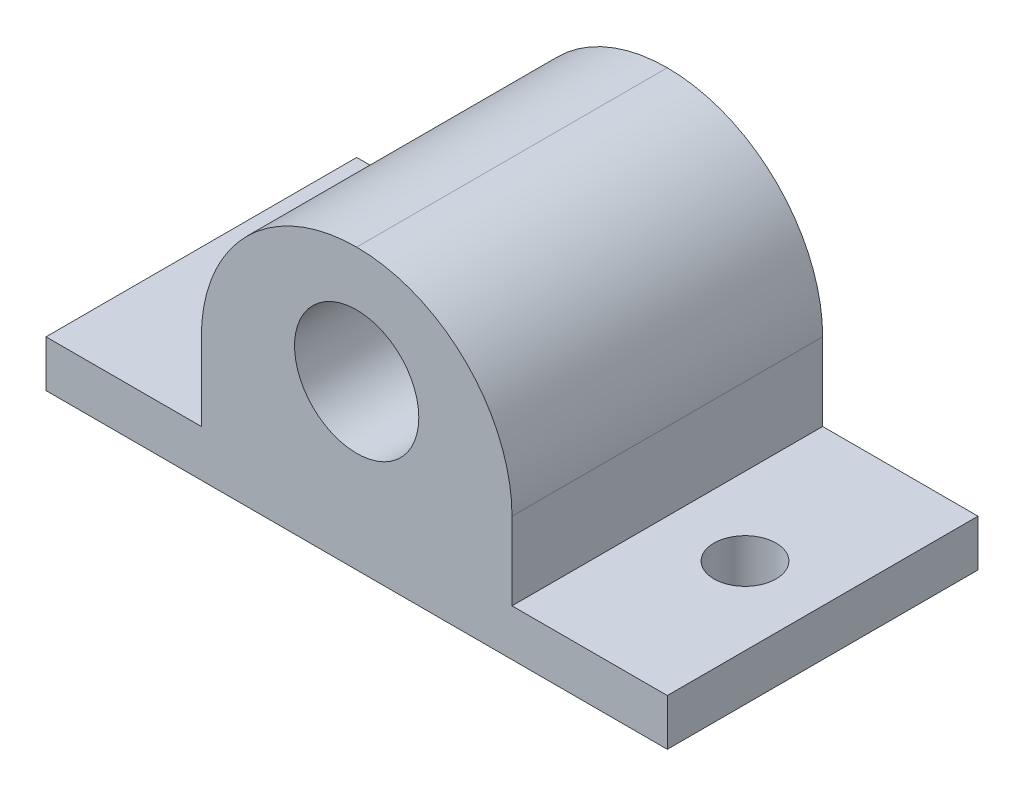
ISO-10303-21;
HEADER;
FILE_DESCRIPTION(('STEP AP214'),'2;1');
FILE_NAME('part.step','',(''),(''),'','','');
FILE_SCHEMA(('AUTOMOTIVE_DESIGN { 1 0 10303 214 1 1 1 1 }'));
ENDSEC;
DATA;
#1=APPLICATION_CONTEXT('core data for automotive mechanical design processes');
#2=APPLICATION_PROTOCOL_DEFINITION('international standard','automotive_design',2000,#1);
#3=PRODUCT_CONTEXT('',#1,'mechanical');
#4=PRODUCT('Part','Part','',(#3));
#5=PRODUCT_RELATED_PRODUCT_CATEGORY('part','',(#4));
#6=PRODUCT_DEFINITION_FORMATION('','',#4);
#7=PRODUCT_DEFINITION_CONTEXT('part definition',#1,'design');
#8=PRODUCT_DEFINITION('design','',#6,#7);
#9=PRODUCT_DEFINITION_SHAPE('','',#8);
#10=(LENGTH_UNIT() NAMED_UNIT(*) SI_UNIT(.MILLI.,.METRE.));
#11=(NAMED_UNIT(*) PLANE_ANGLE_UNIT() SI_UNIT($,.RADIAN.));
#12=(NAMED_UNIT(*) SI_UNIT($,.STERADIAN.) SOLID_ANGLE_UNIT());
#13=UNCERTAINTY_MEASURE_WITH_UNIT(LENGTH_MEASURE(1.E-05),#10,'distance_accuracy_value','');
#14=(GEOMETRIC_REPRESENTATION_CONTEXT(3) GLOBAL_UNCERTAINTY_ASSIGNED_CONTEXT((#13)) GLOBAL_UNIT_ASSIGNED_CONTEXT((#10,
#11,#12)) REPRESENTATION_CONTEXT('',''));
#15=CARTESIAN_POINT('',(0.,0.,0.));
#16=DIRECTION('',(0.,0.,1.));
#17=DIRECTION('',(1.,0.,0.));
#18=AXIS2_PLACEMENT_3D('',#15,#16,#17);
#19=CARTESIAN_POINT('',(0.,3.,0.));
#20=DIRECTION('',(0.,-1.,0.));
#21=DIRECTION('',(0.,0.,-1.));
#22=AXIS2_PLACEMENT_3D('',#19,#20,#21);
#23=PLANE('',#22);
#24=CARTESIAN_POINT('',(5.,3.,-10.));
#25=DIRECTION('',(0.,1.,0.));
#26=DIRECTION('',(0.,0.,1.));
#27=AXIS2_PLACEMENT_3D('',#24,#25,#26);
#28=CIRCLE('',#27,2.);
#29=CARTESIAN_POINT('',(5.,3.,-8.));
#30=VERTEX_POINT('',#29);
#31=EDGE_CURVE('E352',#30,#30,#28,.T.);
#32=ORIENTED_EDGE('',*,*,#31,.F.);
#33=EDGE_LOOP('',(#32));
#34=FACE_BOUND('',#33,.T.);
#35=DIRECTION('',(0.,0.,1.));
#36=VECTOR('',#35,1.);
#37=CARTESIAN_POINT('',(10.,3.,-20.));
#38=LINE('',#37,#36);
#39=CARTESIAN_POINT('',(10.,3.,-20.));
#40=VERTEX_POINT('',#39);
#41=CARTESIAN_POINT('',(10.,3.,0.));
#42=VERTEX_POINT('',#41);
#43=EDGE_CURVE('E127',#40,#42,#38,.T.);
#44=ORIENTED_EDGE('',*,*,#43,.F.);
#45=DIRECTION('',(-1.,0.,0.));
#46=VECTOR('',#45,1.);
#47=CARTESIAN_POINT('',(0.,3.,-20.));
#48=LINE('',#47,#46);
#49=CARTESIAN_POINT('',(0.,3.,-20.));
#50=VERTEX_POINT('',#49);
#51=EDGE_CURVE('E124',#40,#50,#48,.T.);
#52=ORIENTED_EDGE('',*,*,#51,.T.);
#53=DIRECTION('',(0.,0.,1.));
#54=VECTOR('',#53,1.);
#55=CARTESIAN_POINT('',(0.,3.,0.));
#56=LINE('',#55,#54);
#57=CARTESIAN_POINT('',(0.,3.,0.));
#58=VERTEX_POINT('',#57);
#59=EDGE_CURVE('E144',#50,#58,#56,.T.);
#60=ORIENTED_EDGE('',*,*,#59,.T.);
#61=DIRECTION('',(1.,0.,0.));
#62=VECTOR('',#61,1.);
#63=CARTESIAN_POINT('',(0.,3.,0.));
#64=LINE('',#63,#62);
#65=EDGE_CURVE('E154',#58,#42,#64,.T.);
#66=ORIENTED_EDGE('',*,*,#65,.T.);
#67=EDGE_LOOP('',(#44,#52,#60,#66));
#68=FACE_BOUND('',#67,.T.);
#69=ADVANCED_FACE('F33',(#34,#68),#23,.F.);
#70=CARTESIAN_POINT('',(35.,3.,-10.));
#71=DIRECTION('',(0.,1.,0.));
#72=DIRECTION('',(0.,0.,1.));
#73=AXIS2_PLACEMENT_3D('',#70,#71,#72);
#74=CIRCLE('',#73,2.);
#75=CARTESIAN_POINT('',(35.,3.,-8.));
#76=VERTEX_POINT('',#75);
#77=EDGE_CURVE('E354',#76,#76,#74,.T.);
#78=ORIENTED_EDGE('',*,*,#77,.F.);
#79=EDGE_LOOP('',(#78));
#80=FACE_BOUND('',#79,.T.);
#81=DIRECTION('',(0.,0.,-1.));
#82=VECTOR('',#81,1.);
#83=CARTESIAN_POINT('',(30.,3.,-20.));
#84=LINE('',#83,#82);
#85=CARTESIAN_POINT('',(30.,3.,0.));
#86=VERTEX_POINT('',#85);
#87=CARTESIAN_POINT('',(30.,3.,-20.));
#88=VERTEX_POINT('',#87);
#89=EDGE_CURVE('E118',#86,#88,#84,.T.);
#90=ORIENTED_EDGE('',*,*,#89,.F.);
#91=CARTESIAN_POINT('',(40.,3.,0.));
#92=VERTEX_POINT('',#91);
#93=EDGE_CURVE('E147',#86,#92,#64,.T.);
#94=ORIENTED_EDGE('',*,*,#93,.T.);
#95=DIRECTION('',(0.,0.,-1.));
#96=VECTOR('',#95,1.);
#97=CARTESIAN_POINT('',(40.,3.,0.));
#98=LINE('',#97,#96);
#99=CARTESIAN_POINT('',(40.,3.,-20.));
#100=VERTEX_POINT('',#99);
#101=EDGE_CURVE('E121',#92,#100,#98,.T.);
#102=ORIENTED_EDGE('',*,*,#101,.T.);
#103=EDGE_CURVE('E105',#100,#88,#48,.T.);
#104=ORIENTED_EDGE('',*,*,#103,.T.);
#105=EDGE_LOOP('',(#90,#94,#102,#104));
#106=FACE_BOUND('',#105,.T.);
#107=ADVANCED_FACE('F117',(#80,#106),#23,.F.);
#108=CARTESIAN_POINT('',(0.,3.,0.));
#109=DIRECTION('',(1.,0.,0.));
#110=DIRECTION('',(0.,0.,-1.));
#111=AXIS2_PLACEMENT_3D('',#108,#109,#110);
#112=PLANE('',#111);
#113=DIRECTION('',(0.,0.,1.));
#114=VECTOR('',#113,1.);
#115=CARTESIAN_POINT('',(0.,0.,0.));
#116=LINE('',#115,#114);
#117=CARTESIAN_POINT('',(0.,0.,-20.));
#118=VERTEX_POINT('',#117);
#119=CARTESIAN_POINT('',(0.,0.,0.));
#120=VERTEX_POINT('',#119);
#121=EDGE_CURVE('E173',#118,#120,#116,.T.);
#122=ORIENTED_EDGE('',*,*,#121,.T.);
#123=DIRECTION('',(0.,-1.,0.));
#124=VECTOR('',#123,1.);
#125=CARTESIAN_POINT('',(0.,3.,0.));
#126=LINE('',#125,#124);
#127=EDGE_CURVE('E157',#58,#120,#126,.T.);
#128=ORIENTED_EDGE('',*,*,#127,.F.);
#129=ORIENTED_EDGE('',*,*,#59,.F.);
#130=DIRECTION('',(0.,-1.,0.));
#131=VECTOR('',#130,1.);
#132=CARTESIAN_POINT('',(0.,3.,-20.));
#133=LINE('',#132,#131);
#134=EDGE_CURVE('E123',#50,#118,#133,.T.);
#135=ORIENTED_EDGE('',*,*,#134,.T.);
#136=EDGE_LOOP('',(#122,#128,#129,#135));
#137=FACE_BOUND('',#136,.T.);
#138=ADVANCED_FACE('F208',(#137),#112,.F.);
#139=CARTESIAN_POINT('',(0.,3.,0.));
#140=DIRECTION('',(0.,0.,-1.));
#141=DIRECTION('',(-1.,0.,0.));
#142=AXIS2_PLACEMENT_3D('',#139,#140,#141);
#143=PLANE('',#142);
#144=CARTESIAN_POINT('',(20.,10.5,0.));
#145=DIRECTION('',(0.,0.,1.));
#146=DIRECTION('',(1.,0.,0.));
#147=AXIS2_PLACEMENT_3D('',#144,#145,#146);
#148=CIRCLE('',#147,4.);
#149=CARTESIAN_POINT('',(24.,10.5,0.));
#150=VERTEX_POINT('',#149);
#151=EDGE_CURVE('E216',#150,#150,#148,.T.);
#152=ORIENTED_EDGE('',*,*,#151,.F.);
#153=EDGE_LOOP('',(#152));
#154=FACE_BOUND('',#153,.T.);
#155=DIRECTION('',(0.,-1.,0.));
#156=VECTOR('',#155,1.);
#157=CARTESIAN_POINT('',(30.,18.,0.));
#158=LINE('',#157,#156);
#159=CARTESIAN_POINT('',(30.,8.,0.));
#160=VERTEX_POINT('',#159);
#161=EDGE_CURVE('E112',#160,#86,#158,.T.);
#162=ORIENTED_EDGE('',*,*,#161,.F.);
#163=CARTESIAN_POINT('',(20.,8.,0.));
#164=DIRECTION('',(0.,0.,-1.));
#165=DIRECTION('',(-1.,0.,0.));
#166=AXIS2_PLACEMENT_3D('',#163,#164,#165);
#167=CIRCLE('',#166,10.);
#168=CARTESIAN_POINT('',(20.,18.,0.));
#169=VERTEX_POINT('',#168);
#170=EDGE_CURVE('E42',#160,#169,#167,.F.);
#171=ORIENTED_EDGE('',*,*,#170,.T.);
#172=CARTESIAN_POINT('',(20.,8.,0.));
#173=DIRECTION('',(0.,0.,-1.));
#174=DIRECTION('',(-1.,0.,0.));
#175=AXIS2_PLACEMENT_3D('',#172,#173,#174);
#176=CIRCLE('',#175,10.);
#177=CARTESIAN_POINT('',(10.,8.,0.));
#178=VERTEX_POINT('',#177);
#179=EDGE_CURVE('E49',#169,#178,#176,.F.);
#180=ORIENTED_EDGE('',*,*,#179,.T.);
#181=DIRECTION('',(0.,-1.,0.));
#182=VECTOR('',#181,1.);
#183=CARTESIAN_POINT('',(10.,18.,0.));
#184=LINE('',#183,#182);
#185=EDGE_CURVE('E175',#178,#42,#184,.T.);
#186=ORIENTED_EDGE('',*,*,#185,.T.);
#187=ORIENTED_EDGE('',*,*,#65,.F.);
#188=ORIENTED_EDGE('',*,*,#127,.T.);
#189=DIRECTION('',(1.,0.,0.));
#190=VECTOR('',#189,1.);
#191=CARTESIAN_POINT('',(0.,0.,0.));
#192=LINE('',#191,#190);
#193=CARTESIAN_POINT('',(40.,0.,0.));
#194=VERTEX_POINT('',#193);
#195=EDGE_CURVE('E171',#120,#194,#192,.T.);
#196=ORIENTED_EDGE('',*,*,#195,.T.);
#197=DIRECTION('',(0.,-1.,0.));
#198=VECTOR('',#197,1.);
#199=CARTESIAN_POINT('',(40.,3.,0.));
#200=LINE('',#199,#198);
#201=EDGE_CURVE('E161',#92,#194,#200,.T.);
#202=ORIENTED_EDGE('',*,*,#201,.F.);
#203=ORIENTED_EDGE('',*,*,#93,.F.);
#204=EDGE_LOOP('',(#162,#171,#180,#186,#187,#188,#196,#202,#203));
#205=FACE_BOUND('',#204,.T.);
#206=ADVANCED_FACE('F196',(#154,#205),#143,.F.);
#207=CARTESIAN_POINT('',(40.,3.,0.));
#208=DIRECTION('',(-1.,0.,0.));
#209=DIRECTION('',(0.,0.,1.));
#210=AXIS2_PLACEMENT_3D('',#207,#208,#209);
#211=PLANE('',#210);
#212=DIRECTION('',(0.,0.,-1.));
#213=VECTOR('',#212,1.);
#214=CARTESIAN_POINT('',(40.,0.,0.));
#215=LINE('',#214,#213);
#216=CARTESIAN_POINT('',(40.,0.,-20.));
#217=VERTEX_POINT('',#216);
#218=EDGE_CURVE('E169',#194,#217,#215,.T.);
#219=ORIENTED_EDGE('',*,*,#218,.T.);
#220=DIRECTION('',(0.,-1.,0.));
#221=VECTOR('',#220,1.);
#222=CARTESIAN_POINT('',(40.,3.,-20.));
#223=LINE('',#222,#221);
#224=EDGE_CURVE('E164',#100,#217,#223,.T.);
#225=ORIENTED_EDGE('',*,*,#224,.F.);
#226=ORIENTED_EDGE('',*,*,#101,.F.);
#227=ORIENTED_EDGE('',*,*,#201,.T.);
#228=EDGE_LOOP('',(#219,#225,#226,#227));
#229=FACE_BOUND('',#228,.T.);
#230=ADVANCED_FACE('F200',(#229),#211,.F.);
#231=CARTESIAN_POINT('',(0.,3.,-20.));
#232=DIRECTION('',(0.,0.,1.));
#233=DIRECTION('',(1.,0.,0.));
#234=AXIS2_PLACEMENT_3D('',#231,#232,#233);
#235=PLANE('',#234);
#236=CARTESIAN_POINT('',(20.,10.5,-20.));
#237=DIRECTION('',(0.,0.,1.));
#238=DIRECTION('',(1.,0.,0.));
#239=AXIS2_PLACEMENT_3D('',#236,#237,#238);
#240=CIRCLE('',#239,4.);
#241=CARTESIAN_POINT('',(24.,10.5,-20.));
#242=VERTEX_POINT('',#241);
#243=EDGE_CURVE('E131',#242,#242,#240,.T.);
#244=ORIENTED_EDGE('',*,*,#243,.T.);
#245=EDGE_LOOP('',(#244));
#246=FACE_BOUND('',#245,.T.);
#247=CARTESIAN_POINT('',(20.,8.,-20.));
#248=DIRECTION('',(0.,0.,1.));
#249=DIRECTION('',(1.,0.,0.));
#250=AXIS2_PLACEMENT_3D('',#247,#248,#249);
#251=CIRCLE('',#250,10.);
#252=CARTESIAN_POINT('',(10.,8.,-20.));
#253=VERTEX_POINT('',#252);
#254=CARTESIAN_POINT('',(20.,18.,-20.));
#255=VERTEX_POINT('',#254);
#256=EDGE_CURVE('E160',#253,#255,#251,.F.);
#257=ORIENTED_EDGE('',*,*,#256,.T.);
#258=CARTESIAN_POINT('',(20.,8.,-20.));
#259=DIRECTION('',(0.,0.,1.));
#260=DIRECTION('',(1.,0.,0.));
#261=AXIS2_PLACEMENT_3D('',#258,#259,#260);
#262=CIRCLE('',#261,10.);
#263=CARTESIAN_POINT('',(30.,8.,-20.));
#264=VERTEX_POINT('',#263);
#265=EDGE_CURVE('E107',#255,#264,#262,.F.);
#266=ORIENTED_EDGE('',*,*,#265,.T.);
#267=DIRECTION('',(0.,-1.,0.));
#268=VECTOR('',#267,1.);
#269=CARTESIAN_POINT('',(30.,18.,-20.));
#270=LINE('',#269,#268);
#271=EDGE_CURVE('E101',#264,#88,#270,.T.);
#272=ORIENTED_EDGE('',*,*,#271,.T.);
#273=ORIENTED_EDGE('',*,*,#103,.F.);
#274=ORIENTED_EDGE('',*,*,#224,.T.);
#275=DIRECTION('',(-1.,0.,0.));
#276=VECTOR('',#275,1.);
#277=CARTESIAN_POINT('',(0.,0.,-20.));
#278=LINE('',#277,#276);
#279=EDGE_CURVE('E148',#217,#118,#278,.T.);
#280=ORIENTED_EDGE('',*,*,#279,.T.);
#281=ORIENTED_EDGE('',*,*,#134,.F.);
#282=ORIENTED_EDGE('',*,*,#51,.F.);
#283=DIRECTION('',(0.,-1.,0.));
#284=VECTOR('',#283,1.);
#285=CARTESIAN_POINT('',(10.,18.,-20.));
#286=LINE('',#285,#284);
#287=EDGE_CURVE('E113',#253,#40,#286,.T.);
#288=ORIENTED_EDGE('',*,*,#287,.F.);
#289=EDGE_LOOP('',(#257,#266,#272,#273,#274,#280,#281,#282,#288));
#290=FACE_BOUND('',#289,.T.);
#291=ADVANCED_FACE('F103',(#246,#290),#235,.F.);
#292=CARTESIAN_POINT('',(0.,0.,0.));
#293=DIRECTION('',(0.,-1.,0.));
#294=DIRECTION('',(0.,0.,-1.));
#295=AXIS2_PLACEMENT_3D('',#292,#293,#294);
#296=PLANE('',#295);
#297=CARTESIAN_POINT('',(5.,0.,-10.));
#298=DIRECTION('',(0.,1.,0.));
#299=DIRECTION('',(0.,0.,1.));
#300=AXIS2_PLACEMENT_3D('',#297,#298,#299);
#301=CIRCLE('',#300,2.);
#302=CARTESIAN_POINT('',(5.,0.,-8.));
#303=VERTEX_POINT('',#302);
#304=EDGE_CURVE('E350',#303,#303,#301,.T.);
#305=ORIENTED_EDGE('',*,*,#304,.T.);
#306=EDGE_LOOP('',(#305));
#307=FACE_BOUND('',#306,.T.);
#308=CARTESIAN_POINT('',(35.,0.,-10.));
#309=DIRECTION('',(0.,1.,0.));
#310=DIRECTION('',(0.,0.,1.));
#311=AXIS2_PLACEMENT_3D('',#308,#309,#310);
#312=CIRCLE('',#311,2.);
#313=CARTESIAN_POINT('',(35.,0.,-8.));
#314=VERTEX_POINT('',#313);
#315=EDGE_CURVE('E217',#314,#314,#312,.T.);
#316=ORIENTED_EDGE('',*,*,#315,.T.);
#317=EDGE_LOOP('',(#316));
#318=FACE_BOUND('',#317,.T.);
#319=ORIENTED_EDGE('',*,*,#121,.F.);
#320=ORIENTED_EDGE('',*,*,#279,.F.);
#321=ORIENTED_EDGE('',*,*,#218,.F.);
#322=ORIENTED_EDGE('',*,*,#195,.F.);
#323=EDGE_LOOP('',(#319,#320,#321,#322));
#324=FACE_BOUND('',#323,.T.);
#325=ADVANCED_FACE('F241',(#307,#318,#324),#296,.T.);
#326=CARTESIAN_POINT('',(10.,18.,-20.));
#327=DIRECTION('',(1.,0.,0.));
#328=DIRECTION('',(0.,0.,-1.));
#329=AXIS2_PLACEMENT_3D('',#326,#327,#328);
#330=PLANE('',#329);
#331=ORIENTED_EDGE('',*,*,#185,.F.);
#332=DIRECTION('',(0.,0.,1.));
#333=VECTOR('',#332,1.);
#334=CARTESIAN_POINT('',(10.,8.,-20.));
#335=LINE('',#334,#333);
#336=EDGE_CURVE('E11',#178,#253,#335,.F.);
#337=ORIENTED_EDGE('',*,*,#336,.T.);
#338=ORIENTED_EDGE('',*,*,#287,.T.);
#339=ORIENTED_EDGE('',*,*,#43,.T.);
#340=EDGE_LOOP('',(#331,#337,#338,#339));
#341=FACE_BOUND('',#340,.T.);
#342=ADVANCED_FACE('F210',(#341),#330,.F.);
#343=CARTESIAN_POINT('',(30.,18.,-20.));
#344=DIRECTION('',(-1.,0.,0.));
#345=DIRECTION('',(0.,0.,1.));
#346=AXIS2_PLACEMENT_3D('',#343,#344,#345);
#347=PLANE('',#346);
#348=ORIENTED_EDGE('',*,*,#271,.F.);
#349=DIRECTION('',(0.,0.,-1.));
#350=VECTOR('',#349,1.);
#351=CARTESIAN_POINT('',(30.,8.,0.));
#352=LINE('',#351,#350);
#353=EDGE_CURVE('E186',#264,#160,#352,.F.);
#354=ORIENTED_EDGE('',*,*,#353,.T.);
#355=ORIENTED_EDGE('',*,*,#161,.T.);
#356=ORIENTED_EDGE('',*,*,#89,.T.);
#357=EDGE_LOOP('',(#348,#354,#355,#356));
#358=FACE_BOUND('',#357,.T.);
#359=ADVANCED_FACE('F126',(#358),#347,.F.);
#360=CARTESIAN_POINT('',(20.,10.5,-20.00005));
#361=DIRECTION('',(0.,0.,1.));
#362=DIRECTION('',(1.,0.,0.));
#363=AXIS2_PLACEMENT_3D('',#360,#361,#362);
#364=CYLINDRICAL_SURFACE('',#363,4.);
#365=ORIENTED_EDGE('',*,*,#151,.T.);
#366=EDGE_LOOP('',(#365));
#367=FACE_BOUND('',#366,.T.);
#368=ORIENTED_EDGE('',*,*,#243,.F.);
#369=EDGE_LOOP('',(#368));
#370=FACE_BOUND('',#369,.T.);
#371=ADVANCED_FACE('F228',(#367,#370),#364,.F.);
#372=CARTESIAN_POINT('',(20.,8.,0.));
#373=DIRECTION('',(0.,0.,-1.));
#374=DIRECTION('',(-1.,0.,0.));
#375=AXIS2_PLACEMENT_3D('',#372,#373,#374);
#376=CYLINDRICAL_SURFACE('',#375,10.);
#377=ORIENTED_EDGE('',*,*,#336,.F.);
#378=ORIENTED_EDGE('',*,*,#179,.F.);
#379=DIRECTION('',(0.,0.,1.));
#380=VECTOR('',#379,1.);
#381=CARTESIAN_POINT('',(20.,18.,0.));
#382=LINE('',#381,#380);
#383=EDGE_CURVE('E37',#255,#169,#382,.T.);
#384=ORIENTED_EDGE('',*,*,#383,.F.);
#385=ORIENTED_EDGE('',*,*,#256,.F.);
#386=EDGE_LOOP('',(#377,#378,#384,#385));
#387=FACE_BOUND('',#386,.T.);
#388=ADVANCED_FACE('F35',(#387),#376,.T.);
#389=CARTESIAN_POINT('',(20.,8.,0.));
#390=DIRECTION('',(0.,0.,1.));
#391=DIRECTION('',(1.,0.,0.));
#392=AXIS2_PLACEMENT_3D('',#389,#390,#391);
#393=CYLINDRICAL_SURFACE('',#392,10.);
#394=ORIENTED_EDGE('',*,*,#170,.F.);
#395=ORIENTED_EDGE('',*,*,#353,.F.);
#396=ORIENTED_EDGE('',*,*,#265,.F.);
#397=ORIENTED_EDGE('',*,*,#383,.T.);
#398=EDGE_LOOP('',(#394,#395,#396,#397));
#399=FACE_BOUND('',#398,.T.);
#400=ADVANCED_FACE('F218',(#399),#393,.T.);
#401=CARTESIAN_POINT('',(35.,0.,-10.));
#402=DIRECTION('',(0.,1.,0.));
#403=DIRECTION('',(0.,0.,1.));
#404=AXIS2_PLACEMENT_3D('',#401,#402,#403);
#405=CYLINDRICAL_SURFACE('',#404,2.);
#406=ORIENTED_EDGE('',*,*,#315,.F.);
#407=EDGE_LOOP('',(#406));
#408=FACE_BOUND('',#407,.T.);
#409=ORIENTED_EDGE('',*,*,#77,.T.);
#410=EDGE_LOOP('',(#409));
#411=FACE_BOUND('',#410,.T.);
#412=ADVANCED_FACE('F220',(#408,#411),#405,.F.);
#413=CARTESIAN_POINT('',(5.,0.,-10.));
#414=DIRECTION('',(0.,1.,0.));
#415=DIRECTION('',(0.,0.,1.));
#416=AXIS2_PLACEMENT_3D('',#413,#414,#415);
#417=CYLINDRICAL_SURFACE('',#416,2.);
#418=ORIENTED_EDGE('',*,*,#304,.F.);
#419=EDGE_LOOP('',(#418));
#420=FACE_BOUND('',#419,.T.);
#421=ORIENTED_EDGE('',*,*,#31,.T.);
#422=EDGE_LOOP('',(#421));
#423=FACE_BOUND('',#422,.T.);
#424=ADVANCED_FACE('F225',(#420,#423),#417,.F.);
#425=CLOSED_SHELL('',(#69,#107,#138,#206,#230,#291,#325,#342,#359,#371,#388,#400,#412,#424));
#426=MANIFOLD_SOLID_BREP('B2',#425);
#427=ADVANCED_BREP_SHAPE_REPRESENTATION('',(#18,#426),#14);
#428=SHAPE_DEFINITION_REPRESENTATION(#9,#427);
ENDSEC;
END-ISO-10303-21;
